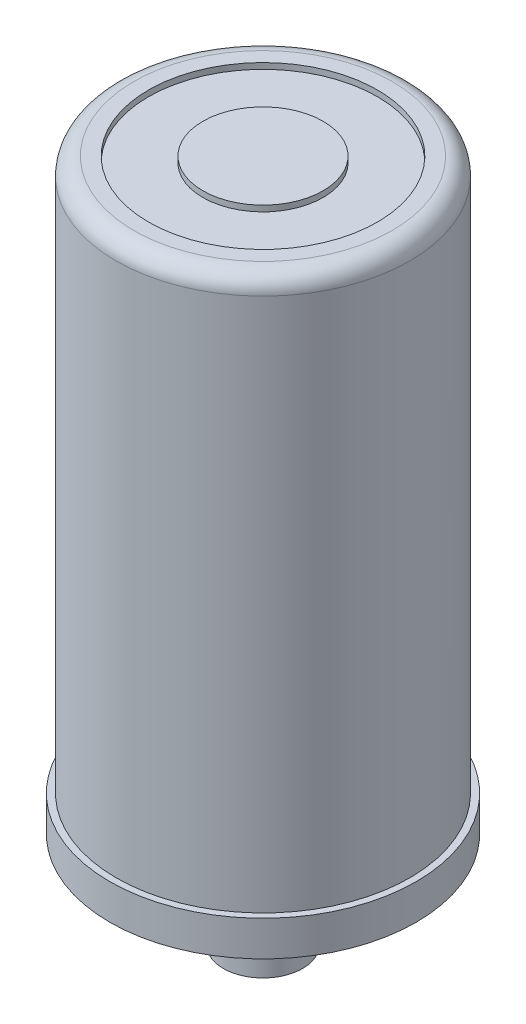
ISO-10303-21;
HEADER;
FILE_DESCRIPTION(('STEP AP214'),'2;1');
FILE_NAME('part.step','',(''),(''),'','','');
FILE_SCHEMA(('AUTOMOTIVE_DESIGN { 1 0 10303 214 1 1 1 1 }'));
ENDSEC;
DATA;
#1=APPLICATION_CONTEXT('core data for automotive mechanical design processes');
#2=APPLICATION_PROTOCOL_DEFINITION('international standard','automotive_design',2000,#1);
#3=PRODUCT_CONTEXT('',#1,'mechanical');
#4=PRODUCT('Part','Part','',(#3));
#5=PRODUCT_RELATED_PRODUCT_CATEGORY('part','',(#4));
#6=PRODUCT_DEFINITION_FORMATION('','',#4);
#7=PRODUCT_DEFINITION_CONTEXT('part definition',#1,'design');
#8=PRODUCT_DEFINITION('design','',#6,#7);
#9=PRODUCT_DEFINITION_SHAPE('','',#8);
#10=(LENGTH_UNIT() NAMED_UNIT(*) SI_UNIT(.MILLI.,.METRE.));
#11=(NAMED_UNIT(*) PLANE_ANGLE_UNIT() SI_UNIT($,.RADIAN.));
#12=(NAMED_UNIT(*) SI_UNIT($,.STERADIAN.) SOLID_ANGLE_UNIT());
#13=UNCERTAINTY_MEASURE_WITH_UNIT(LENGTH_MEASURE(1.E-05),#10,'distance_accuracy_value','');
#14=(GEOMETRIC_REPRESENTATION_CONTEXT(3) GLOBAL_UNCERTAINTY_ASSIGNED_CONTEXT((#13)) GLOBAL_UNIT_ASSIGNED_CONTEXT((#10,
#11,#12)) REPRESENTATION_CONTEXT('',''));
#15=CARTESIAN_POINT('',(0.,0.,0.));
#16=DIRECTION('',(0.,0.,1.));
#17=DIRECTION('',(1.,0.,0.));
#18=AXIS2_PLACEMENT_3D('',#15,#16,#17);
#19=CARTESIAN_POINT('',(-10.5300705660028,116.5,10.25));
#20=DIRECTION('',(0.,1.,0.));
#21=DIRECTION('',(1.,0.,0.));
#22=AXIS2_PLACEMENT_3D('',#19,#20,#21);
#23=PLANE('',#22);
#24=CARTESIAN_POINT('',(0.,116.5,0.));
#25=DIRECTION('',(0.,1.,0.));
#26=DIRECTION('',(0.,0.,-1.));
#27=AXIS2_PLACEMENT_3D('',#24,#25,#26);
#28=CIRCLE('',#27,10.25);
#29=CARTESIAN_POINT('',(0.,116.5,-10.25));
#30=VERTEX_POINT('',#29);
#31=EDGE_CURVE('E52',#30,#30,#28,.F.);
#32=ORIENTED_EDGE('',*,*,#31,.F.);
#33=EDGE_LOOP('',(#32));
#34=FACE_BOUND('',#33,.T.);
#35=ADVANCED_FACE('F14',(#34),#23,.T.);
#36=CARTESIAN_POINT('',(-19.8622386915088,115.5,19.5));
#37=DIRECTION('',(0.,1.,0.));
#38=DIRECTION('',(1.,0.,0.));
#39=AXIS2_PLACEMENT_3D('',#36,#37,#38);
#40=PLANE('',#39);
#41=CARTESIAN_POINT('',(0.,115.5,0.));
#42=DIRECTION('',(0.,1.,0.));
#43=DIRECTION('',(0.,0.,-1.));
#44=AXIS2_PLACEMENT_3D('',#41,#42,#43);
#45=CIRCLE('',#44,19.5);
#46=CARTESIAN_POINT('',(0.,115.5,-19.5));
#47=VERTEX_POINT('',#46);
#48=EDGE_CURVE('E49',#47,#47,#45,.F.);
#49=ORIENTED_EDGE('',*,*,#48,.F.);
#50=EDGE_LOOP('',(#49));
#51=FACE_BOUND('',#50,.T.);
#52=CARTESIAN_POINT('',(0.,115.5,0.));
#53=DIRECTION('',(0.,-1.,0.));
#54=DIRECTION('',(-1.16852600224708E-09,0.,1.));
#55=AXIS2_PLACEMENT_3D('',#52,#53,#54);
#56=CIRCLE('',#55,10.25);
#57=CARTESIAN_POINT('',(-1.19773915230326E-08,115.5,10.25));
#58=VERTEX_POINT('',#57);
#59=EDGE_CURVE('E46',#58,#58,#56,.T.);
#60=ORIENTED_EDGE('',*,*,#59,.T.);
#61=EDGE_LOOP('',(#60));
#62=FACE_BOUND('',#61,.T.);
#63=ADVANCED_FACE('F59',(#51,#62),#40,.T.);
#64=CARTESIAN_POINT('',(-22.4086795623413,116.5,22.));
#65=DIRECTION('',(0.,1.,0.));
#66=DIRECTION('',(1.,0.,0.));
#67=AXIS2_PLACEMENT_3D('',#64,#65,#66);
#68=PLANE('',#67);
#69=CARTESIAN_POINT('',(0.,116.5,0.));
#70=DIRECTION('',(0.,1.,0.));
#71=DIRECTION('',(0.,0.,-1.));
#72=AXIS2_PLACEMENT_3D('',#69,#70,#71);
#73=CIRCLE('',#72,22.);
#74=CARTESIAN_POINT('',(0.,116.5,-22.));
#75=VERTEX_POINT('',#74);
#76=EDGE_CURVE('E43',#75,#75,#73,.F.);
#77=ORIENTED_EDGE('',*,*,#76,.F.);
#78=EDGE_LOOP('',(#77));
#79=FACE_BOUND('',#78,.T.);
#80=CARTESIAN_POINT('',(0.,116.5,0.));
#81=DIRECTION('',(0.,-1.,0.));
#82=DIRECTION('',(0.,0.,1.));
#83=AXIS2_PLACEMENT_3D('',#80,#81,#82);
#84=CIRCLE('',#83,19.5);
#85=CARTESIAN_POINT('',(0.,116.5,19.5));
#86=VERTEX_POINT('',#85);
#87=EDGE_CURVE('E40',#86,#86,#84,.T.);
#88=ORIENTED_EDGE('',*,*,#87,.T.);
#89=EDGE_LOOP('',(#88));
#90=FACE_BOUND('',#89,.T.);
#91=ADVANCED_FACE('F65',(#79,#90),#68,.T.);
#92=CARTESIAN_POINT('',(-26.5848425716867,22.5,26.1));
#93=DIRECTION('',(0.,1.,0.));
#94=DIRECTION('',(1.,0.,0.));
#95=AXIS2_PLACEMENT_3D('',#92,#93,#94);
#96=PLANE('',#95);
#97=CARTESIAN_POINT('',(0.,22.5,0.));
#98=DIRECTION('',(0.,1.,0.));
#99=DIRECTION('',(0.,0.,-1.));
#100=AXIS2_PLACEMENT_3D('',#97,#98,#99);
#101=CIRCLE('',#100,26.1);
#102=CARTESIAN_POINT('',(0.,22.5,-26.1));
#103=VERTEX_POINT('',#102);
#104=EDGE_CURVE('E37',#103,#103,#101,.F.);
#105=ORIENTED_EDGE('',*,*,#104,.F.);
#106=EDGE_LOOP('',(#105));
#107=FACE_BOUND('',#106,.T.);
#108=CARTESIAN_POINT('',(0.,22.5,0.));
#109=DIRECTION('',(0.,-1.,0.));
#110=DIRECTION('',(-1.16851694542675E-09,0.,1.));
#111=AXIS2_PLACEMENT_3D('',#108,#109,#110);
#112=CIRCLE('',#111,25.);
#113=CARTESIAN_POINT('',(-2.92129236356686E-08,22.5,25.));
#114=VERTEX_POINT('',#113);
#115=EDGE_CURVE('E34',#114,#114,#112,.T.);
#116=ORIENTED_EDGE('',*,*,#115,.T.);
#117=EDGE_LOOP('',(#116));
#118=FACE_BOUND('',#117,.T.);
#119=ADVANCED_FACE('F71',(#107,#118),#96,.T.);
#120=CARTESIAN_POINT('',(-26.5848425716867,16.5,-26.1));
#121=DIRECTION('',(0.,-1.,0.));
#122=DIRECTION('',(1.,0.,0.));
#123=AXIS2_PLACEMENT_3D('',#120,#121,#122);
#124=PLANE('',#123);
#125=CARTESIAN_POINT('',(0.,16.5,0.));
#126=DIRECTION('',(0.,-1.,0.));
#127=DIRECTION('',(0.,0.,1.));
#128=AXIS2_PLACEMENT_3D('',#125,#126,#127);
#129=CIRCLE('',#128,26.1);
#130=CARTESIAN_POINT('',(0.,16.5,26.1));
#131=VERTEX_POINT('',#130);
#132=EDGE_CURVE('E29',#131,#131,#129,.T.);
#133=ORIENTED_EDGE('',*,*,#132,.T.);
#134=EDGE_LOOP('',(#133));
#135=FACE_BOUND('',#134,.T.);
#136=CARTESIAN_POINT('',(0.,16.5,0.));
#137=DIRECTION('',(0.,1.,0.));
#138=DIRECTION('',(0.,0.,-1.));
#139=AXIS2_PLACEMENT_3D('',#136,#137,#138);
#140=CIRCLE('',#139,6.75);
#141=CARTESIAN_POINT('',(0.,16.5,-6.75));
#142=VERTEX_POINT('',#141);
#143=EDGE_CURVE('E25',#142,#142,#140,.F.);
#144=ORIENTED_EDGE('',*,*,#143,.F.);
#145=EDGE_LOOP('',(#144));
#146=FACE_BOUND('',#145,.T.);
#147=ADVANCED_FACE('F75',(#135,#146),#124,.T.);
#148=CARTESIAN_POINT('',(-6.93443671419696,0.,-6.75));
#149=DIRECTION('',(0.,-1.,0.));
#150=DIRECTION('',(1.,0.,0.));
#151=AXIS2_PLACEMENT_3D('',#148,#149,#150);
#152=PLANE('',#151);
#153=CARTESIAN_POINT('',(0.,0.,0.));
#154=DIRECTION('',(0.,-1.,0.));
#155=DIRECTION('',(0.,0.,1.));
#156=AXIS2_PLACEMENT_3D('',#153,#154,#155);
#157=CIRCLE('',#156,6.75);
#158=CARTESIAN_POINT('',(0.,0.,6.75));
#159=VERTEX_POINT('',#158);
#160=EDGE_CURVE('E21',#159,#159,#157,.T.);
#161=ORIENTED_EDGE('',*,*,#160,.T.);
#162=EDGE_LOOP('',(#161));
#163=FACE_BOUND('',#162,.T.);
#164=ADVANCED_FACE('F79',(#163),#152,.T.);
#165=CARTESIAN_POINT('',(0.,0.,0.));
#166=DIRECTION('',(0.,-1.,0.));
#167=DIRECTION('',(0.,0.,1.));
#168=AXIS2_PLACEMENT_3D('',#165,#166,#167);
#169=CYLINDRICAL_SURFACE('',#168,10.25);
#170=ORIENTED_EDGE('',*,*,#59,.F.);
#171=EDGE_LOOP('',(#170));
#172=FACE_BOUND('',#171,.T.);
#173=ORIENTED_EDGE('',*,*,#31,.T.);
#174=EDGE_LOOP('',(#173));
#175=FACE_BOUND('',#174,.T.);
#176=ADVANCED_FACE('F56',(#172,#175),#169,.T.);
#177=CARTESIAN_POINT('',(0.,0.,0.));
#178=DIRECTION('',(0.,-1.,0.));
#179=DIRECTION('',(1.16832911157425E-09,0.,1.));
#180=AXIS2_PLACEMENT_3D('',#177,#178,#179);
#181=CYLINDRICAL_SURFACE('',#180,19.5);
#182=ORIENTED_EDGE('',*,*,#87,.F.);
#183=EDGE_LOOP('',(#182));
#184=FACE_BOUND('',#183,.T.);
#185=ORIENTED_EDGE('',*,*,#48,.T.);
#186=EDGE_LOOP('',(#185));
#187=FACE_BOUND('',#186,.T.);
#188=ADVANCED_FACE('F85',(#184,#187),#181,.F.);
#189=CARTESIAN_POINT('',(0.,113.500000000001,0.));
#190=DIRECTION('',(0.,-1.,0.));
#191=DIRECTION('',(1.92336491518372E-10,0.,1.));
#192=AXIS2_PLACEMENT_3D('',#189,#190,#191);
#193=TOROIDAL_SURFACE('',#192,22.0000000000012,2.99999999999878);
#194=ORIENTED_EDGE('',*,*,#76,.T.);
#195=EDGE_LOOP('',(#194));
#196=FACE_BOUND('',#195,.T.);
#197=CARTESIAN_POINT('',(0.,113.500000000001,0.));
#198=DIRECTION('',(0.,1.,0.));
#199=DIRECTION('',(0.,0.,-1.));
#200=AXIS2_PLACEMENT_3D('',#197,#198,#199);
#201=CIRCLE('',#200,25.);
#202=CARTESIAN_POINT('',(0.,113.500000000001,-25.));
#203=VERTEX_POINT('',#202);
#204=EDGE_CURVE('E10',#203,#203,#201,.F.);
#205=ORIENTED_EDGE('',*,*,#204,.F.);
#206=EDGE_LOOP('',(#205));
#207=FACE_BOUND('',#206,.T.);
#208=ADVANCED_FACE('F89',(#196,#207),#193,.T.);
#209=CARTESIAN_POINT('',(0.,0.,0.));
#210=DIRECTION('',(0.,-1.,0.));
#211=DIRECTION('',(1.92336491518372E-10,0.,1.));
#212=AXIS2_PLACEMENT_3D('',#209,#210,#211);
#213=CYLINDRICAL_SURFACE('',#212,25.);
#214=ORIENTED_EDGE('',*,*,#115,.F.);
#215=EDGE_LOOP('',(#214));
#216=FACE_BOUND('',#215,.T.);
#217=ORIENTED_EDGE('',*,*,#204,.T.);
#218=EDGE_LOOP('',(#217));
#219=FACE_BOUND('',#218,.T.);
#220=ADVANCED_FACE('F93',(#216,#219),#213,.T.);
#221=CARTESIAN_POINT('',(0.,0.,0.));
#222=DIRECTION('',(0.,-1.,0.));
#223=DIRECTION('',(0.,0.,1.));
#224=AXIS2_PLACEMENT_3D('',#221,#222,#223);
#225=CYLINDRICAL_SURFACE('',#224,26.1);
#226=ORIENTED_EDGE('',*,*,#132,.F.);
#227=EDGE_LOOP('',(#226));
#228=FACE_BOUND('',#227,.T.);
#229=ORIENTED_EDGE('',*,*,#104,.T.);
#230=EDGE_LOOP('',(#229));
#231=FACE_BOUND('',#230,.T.);
#232=ADVANCED_FACE('F96',(#228,#231),#225,.T.);
#233=CARTESIAN_POINT('',(0.,0.,0.));
#234=DIRECTION('',(0.,-1.,0.));
#235=DIRECTION('',(0.,0.,1.));
#236=AXIS2_PLACEMENT_3D('',#233,#234,#235);
#237=CYLINDRICAL_SURFACE('',#236,6.75);
#238=ORIENTED_EDGE('',*,*,#160,.F.);
#239=EDGE_LOOP('',(#238));
#240=FACE_BOUND('',#239,.T.);
#241=ORIENTED_EDGE('',*,*,#143,.T.);
#242=EDGE_LOOP('',(#241));
#243=FACE_BOUND('',#242,.T.);
#244=ADVANCED_FACE('F16',(#240,#243),#237,.T.);
#245=CLOSED_SHELL('',(#35,#63,#91,#119,#147,#164,#176,#188,#208,#220,#232,#244));
#246=MANIFOLD_SOLID_BREP('B1',#245);
#247=ADVANCED_BREP_SHAPE_REPRESENTATION('',(#18,#246),#14);
#248=SHAPE_DEFINITION_REPRESENTATION(#9,#247);
ENDSEC;
END-ISO-10303-21;
